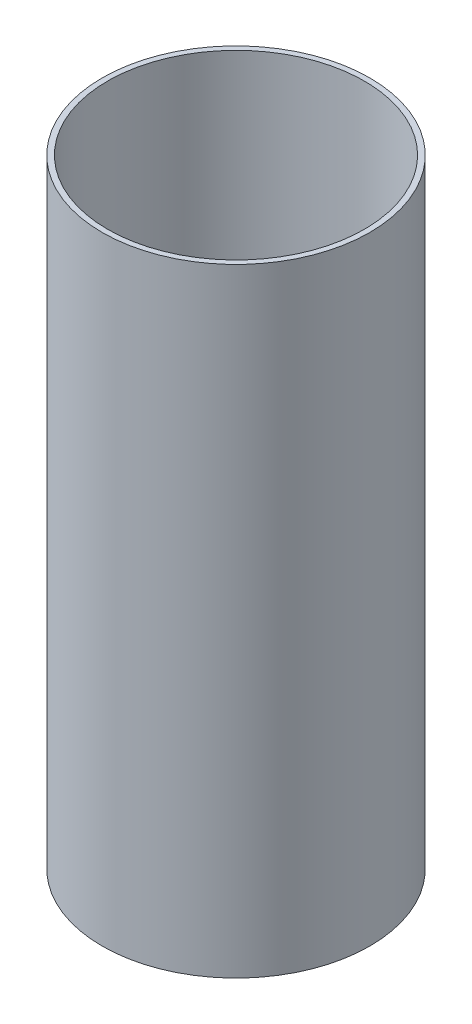
ISO-10303-21;
HEADER;
FILE_DESCRIPTION(('STEP AP214'),'2;1');
FILE_NAME('part.step','',(''),(''),'','','');
FILE_SCHEMA(('AUTOMOTIVE_DESIGN { 1 0 10303 214 1 1 1 1 }'));
ENDSEC;
DATA;
#1=APPLICATION_CONTEXT('core data for automotive mechanical design processes');
#2=APPLICATION_PROTOCOL_DEFINITION('international standard','automotive_design',2000,#1);
#3=PRODUCT_CONTEXT('',#1,'mechanical');
#4=PRODUCT('Part','Part','',(#3));
#5=PRODUCT_RELATED_PRODUCT_CATEGORY('part','',(#4));
#6=PRODUCT_DEFINITION_FORMATION('','',#4);
#7=PRODUCT_DEFINITION_CONTEXT('part definition',#1,'design');
#8=PRODUCT_DEFINITION('design','',#6,#7);
#9=PRODUCT_DEFINITION_SHAPE('','',#8);
#10=(LENGTH_UNIT() NAMED_UNIT(*) SI_UNIT(.MILLI.,.METRE.));
#11=(NAMED_UNIT(*) PLANE_ANGLE_UNIT() SI_UNIT($,.RADIAN.));
#12=(NAMED_UNIT(*) SI_UNIT($,.STERADIAN.) SOLID_ANGLE_UNIT());
#13=UNCERTAINTY_MEASURE_WITH_UNIT(LENGTH_MEASURE(1.E-05),#10,'distance_accuracy_value','');
#14=(GEOMETRIC_REPRESENTATION_CONTEXT(3) GLOBAL_UNCERTAINTY_ASSIGNED_CONTEXT((#13)) GLOBAL_UNIT_ASSIGNED_CONTEXT((#10,
#11,#12)) REPRESENTATION_CONTEXT('',''));
#15=CARTESIAN_POINT('',(0.,0.,0.));
#16=DIRECTION('',(0.,0.,1.));
#17=DIRECTION('',(1.,0.,0.));
#18=AXIS2_PLACEMENT_3D('',#15,#16,#17);
#19=CARTESIAN_POINT('',(0.,228.6,0.));
#20=DIRECTION('',(0.,1.,0.));
#21=DIRECTION('',(0.,0.,1.));
#22=AXIS2_PLACEMENT_3D('',#19,#20,#21);
#23=PLANE('',#22);
#24=CARTESIAN_POINT('',(0.,228.6,0.));
#25=DIRECTION('',(0.,1.,0.));
#26=DIRECTION('',(0.,0.,1.));
#27=AXIS2_PLACEMENT_3D('',#24,#25,#26);
#28=CIRCLE('',#27,49.5046);
#29=CARTESIAN_POINT('',(0.,228.6,49.5046));
#30=VERTEX_POINT('',#29);
#31=EDGE_CURVE('E10',#30,#30,#28,.T.);
#32=ORIENTED_EDGE('',*,*,#31,.T.);
#33=EDGE_LOOP('',(#32));
#34=FACE_BOUND('',#33,.T.);
#35=CARTESIAN_POINT('',(0.,228.6,0.));
#36=DIRECTION('',(0.,1.,0.));
#37=DIRECTION('',(0.,0.,1.));
#38=AXIS2_PLACEMENT_3D('',#35,#36,#37);
#39=CIRCLE('',#38,47.498);
#40=CARTESIAN_POINT('',(0.,228.6,47.498));
#41=VERTEX_POINT('',#40);
#42=EDGE_CURVE('E48',#41,#41,#39,.T.);
#43=ORIENTED_EDGE('',*,*,#42,.F.);
#44=EDGE_LOOP('',(#43));
#45=FACE_BOUND('',#44,.T.);
#46=ADVANCED_FACE('F37',(#34,#45),#23,.T.);
#47=CARTESIAN_POINT('',(0.,0.,0.));
#48=DIRECTION('',(0.,1.,0.));
#49=DIRECTION('',(0.,0.,1.));
#50=AXIS2_PLACEMENT_3D('',#47,#48,#49);
#51=PLANE('',#50);
#52=CARTESIAN_POINT('',(0.,0.,0.));
#53=DIRECTION('',(0.,1.,0.));
#54=DIRECTION('',(0.,0.,1.));
#55=AXIS2_PLACEMENT_3D('',#52,#53,#54);
#56=CIRCLE('',#55,49.5046);
#57=CARTESIAN_POINT('',(0.,0.,49.5046));
#58=VERTEX_POINT('',#57);
#59=EDGE_CURVE('E41',#58,#58,#56,.T.);
#60=ORIENTED_EDGE('',*,*,#59,.F.);
#61=EDGE_LOOP('',(#60));
#62=FACE_BOUND('',#61,.T.);
#63=CARTESIAN_POINT('',(0.,0.,0.));
#64=DIRECTION('',(0.,1.,0.));
#65=DIRECTION('',(0.,0.,1.));
#66=AXIS2_PLACEMENT_3D('',#63,#64,#65);
#67=CIRCLE('',#66,47.498);
#68=CARTESIAN_POINT('',(0.,0.,47.498));
#69=VERTEX_POINT('',#68);
#70=EDGE_CURVE('E50',#69,#69,#67,.T.);
#71=ORIENTED_EDGE('',*,*,#70,.T.);
#72=EDGE_LOOP('',(#71));
#73=FACE_BOUND('',#72,.T.);
#74=ADVANCED_FACE('F60',(#62,#73),#51,.F.);
#75=CARTESIAN_POINT('',(0.,228.6,0.));
#76=DIRECTION('',(0.,-1.,0.));
#77=DIRECTION('',(0.,0.,-1.));
#78=AXIS2_PLACEMENT_3D('',#75,#76,#77);
#79=CYLINDRICAL_SURFACE('',#78,49.5046);
#80=ORIENTED_EDGE('',*,*,#31,.F.);
#81=EDGE_LOOP('',(#80));
#82=FACE_BOUND('',#81,.T.);
#83=ORIENTED_EDGE('',*,*,#59,.T.);
#84=EDGE_LOOP('',(#83));
#85=FACE_BOUND('',#84,.T.);
#86=ADVANCED_FACE('F39',(#82,#85),#79,.T.);
#87=CARTESIAN_POINT('',(0.,228.6,0.));
#88=DIRECTION('',(0.,-1.,0.));
#89=DIRECTION('',(0.,0.,-1.));
#90=AXIS2_PLACEMENT_3D('',#87,#88,#89);
#91=CYLINDRICAL_SURFACE('',#90,47.498);
#92=ORIENTED_EDGE('',*,*,#42,.T.);
#93=EDGE_LOOP('',(#92));
#94=FACE_BOUND('',#93,.T.);
#95=ORIENTED_EDGE('',*,*,#70,.F.);
#96=EDGE_LOOP('',(#95));
#97=FACE_BOUND('',#96,.T.);
#98=ADVANCED_FACE('F56',(#94,#97),#91,.F.);
#99=CLOSED_SHELL('',(#46,#74,#86,#98));
#100=MANIFOLD_SOLID_BREP('B2',#99);
#101=ADVANCED_BREP_SHAPE_REPRESENTATION('',(#18,#100),#14);
#102=SHAPE_DEFINITION_REPRESENTATION(#9,#101);
ENDSEC;
END-ISO-10303-21;
